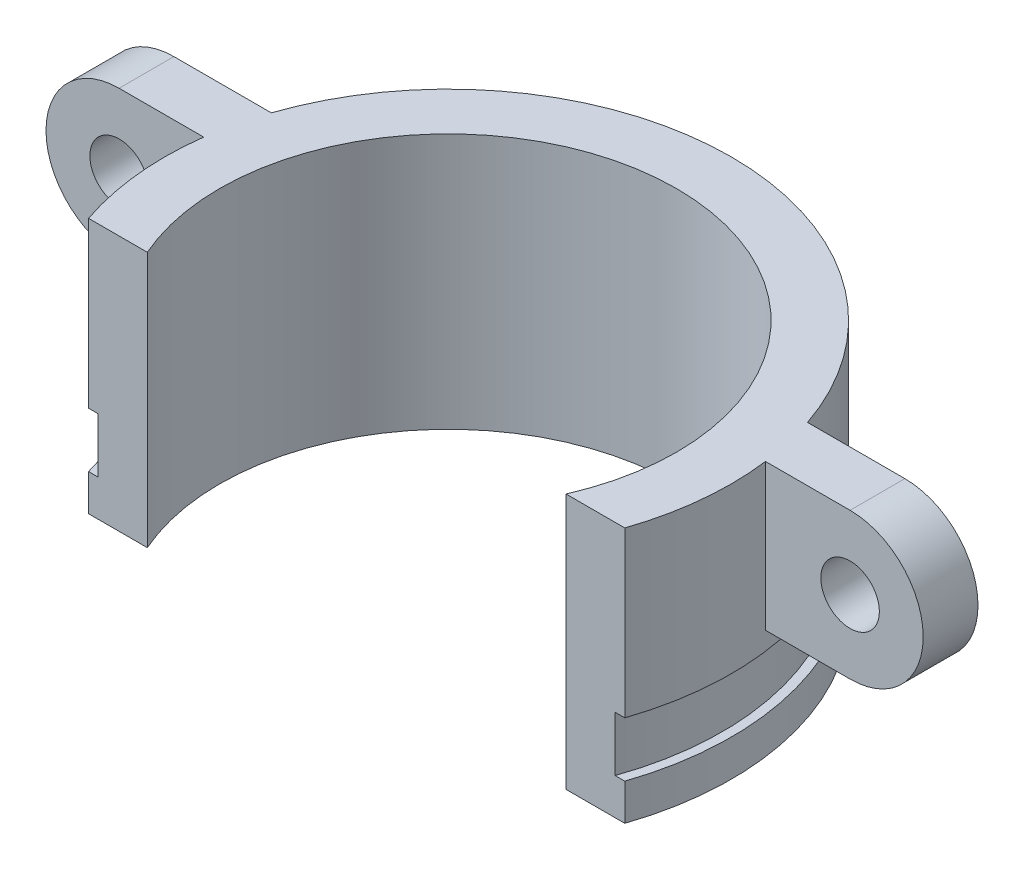
ISO-10303-21;
HEADER;
FILE_DESCRIPTION(('STEP AP214'),'2;1');
FILE_NAME('part.step','',(''),(''),'','','');
FILE_SCHEMA(('AUTOMOTIVE_DESIGN { 1 0 10303 214 1 1 1 1 }'));
ENDSEC;
DATA;
#1=APPLICATION_CONTEXT('core data for automotive mechanical design processes');
#2=APPLICATION_PROTOCOL_DEFINITION('international standard','automotive_design',2000,#1);
#3=PRODUCT_CONTEXT('',#1,'mechanical');
#4=PRODUCT('Part','Part','',(#3));
#5=PRODUCT_RELATED_PRODUCT_CATEGORY('part','',(#4));
#6=PRODUCT_DEFINITION_FORMATION('','',#4);
#7=PRODUCT_DEFINITION_CONTEXT('part definition',#1,'design');
#8=PRODUCT_DEFINITION('design','',#6,#7);
#9=PRODUCT_DEFINITION_SHAPE('','',#8);
#10=(LENGTH_UNIT() NAMED_UNIT(*) SI_UNIT(.MILLI.,.METRE.));
#11=(NAMED_UNIT(*) PLANE_ANGLE_UNIT() SI_UNIT($,.RADIAN.));
#12=(NAMED_UNIT(*) SI_UNIT($,.STERADIAN.) SOLID_ANGLE_UNIT());
#13=UNCERTAINTY_MEASURE_WITH_UNIT(LENGTH_MEASURE(1.E-05),#10,'distance_accuracy_value','');
#14=(GEOMETRIC_REPRESENTATION_CONTEXT(3) GLOBAL_UNCERTAINTY_ASSIGNED_CONTEXT((#13)) GLOBAL_UNIT_ASSIGNED_CONTEXT((#10,
#11,#12)) REPRESENTATION_CONTEXT('',''));
#15=CARTESIAN_POINT('',(0.,0.,0.));
#16=DIRECTION('',(0.,0.,1.));
#17=DIRECTION('',(1.,0.,0.));
#18=AXIS2_PLACEMENT_3D('',#15,#16,#17);
#19=CARTESIAN_POINT('',(0.,0.,0.));
#20=DIRECTION('',(0.,-1.,0.));
#21=DIRECTION('',(0.,0.,-1.));
#22=AXIS2_PLACEMENT_3D('',#19,#20,#21);
#23=CYLINDRICAL_SURFACE('',#22,15.5);
#24=CARTESIAN_POINT('',(0.,49.,0.));
#25=DIRECTION('',(0.,1.,0.));
#26=DIRECTION('',(-1.,0.,0.));
#27=AXIS2_PLACEMENT_3D('',#24,#25,#26);
#28=CIRCLE('',#27,15.5);
#29=CARTESIAN_POINT('',(-14.6714007511212,49.,-5.));
#30=VERTEX_POINT('',#29);
#31=CARTESIAN_POINT('',(14.6714007511212,49.,-5.));
#32=VERTEX_POINT('',#31);
#33=EDGE_CURVE('E166',#30,#32,#28,.F.);
#34=ORIENTED_EDGE('',*,*,#33,.T.);
#35=DIRECTION('',(0.,-1.,0.));
#36=VECTOR('',#35,1.);
#37=CARTESIAN_POINT('',(14.6714007511212,0.,-5.));
#38=LINE('',#37,#36);
#39=CARTESIAN_POINT('',(14.6714007511212,41.,-5.));
#40=VERTEX_POINT('',#39);
#41=EDGE_CURVE('E41',#40,#32,#38,.F.);
#42=ORIENTED_EDGE('',*,*,#41,.F.);
#43=CARTESIAN_POINT('',(0.,41.,0.));
#44=DIRECTION('',(0.,-1.,0.));
#45=DIRECTION('',(0.,0.,-1.));
#46=AXIS2_PLACEMENT_3D('',#43,#44,#45);
#47=CIRCLE('',#46,15.5);
#48=CARTESIAN_POINT('',(15.3704261489394,41.,-2.));
#49=VERTEX_POINT('',#48);
#50=EDGE_CURVE('E220',#49,#40,#47,.F.);
#51=ORIENTED_EDGE('',*,*,#50,.F.);
#52=DIRECTION('',(0.,-1.,0.));
#53=VECTOR('',#52,1.);
#54=CARTESIAN_POINT('',(15.3704261489394,0.,-2.));
#55=LINE('',#54,#53);
#56=CARTESIAN_POINT('',(15.3704261489394,49.,-2.));
#57=VERTEX_POINT('',#56);
#58=EDGE_CURVE('E163',#49,#57,#55,.F.);
#59=ORIENTED_EDGE('',*,*,#58,.T.);
#60=CARTESIAN_POINT('',(14.6714007511212,49.,5.));
#61=VERTEX_POINT('',#60);
#62=EDGE_CURVE('E147',#57,#61,#28,.F.);
#63=ORIENTED_EDGE('',*,*,#62,.T.);
#64=DIRECTION('',(0.,1.,0.));
#65=VECTOR('',#64,1.);
#66=CARTESIAN_POINT('',(14.6714007511212,0.,5.));
#67=LINE('',#66,#65);
#68=CARTESIAN_POINT('',(14.6714007511212,40.,5.));
#69=VERTEX_POINT('',#68);
#70=EDGE_CURVE('E160',#69,#61,#67,.T.);
#71=ORIENTED_EDGE('',*,*,#70,.F.);
#72=CARTESIAN_POINT('',(0.,40.,0.));
#73=DIRECTION('',(0.,-1.,0.));
#74=DIRECTION('',(0.,0.,-1.));
#75=AXIS2_PLACEMENT_3D('',#72,#73,#74);
#76=CIRCLE('',#75,15.5);
#77=CARTESIAN_POINT('',(-14.6714007511212,40.,5.));
#78=VERTEX_POINT('',#77);
#79=EDGE_CURVE('E203',#78,#69,#76,.T.);
#80=ORIENTED_EDGE('',*,*,#79,.F.);
#81=DIRECTION('',(0.,1.,0.));
#82=VECTOR('',#81,1.);
#83=CARTESIAN_POINT('',(-14.6714007511212,0.,5.));
#84=LINE('',#83,#82);
#85=CARTESIAN_POINT('',(-14.6714007511212,49.,5.));
#86=VERTEX_POINT('',#85);
#87=EDGE_CURVE('E174',#78,#86,#84,.T.);
#88=ORIENTED_EDGE('',*,*,#87,.T.);
#89=CARTESIAN_POINT('',(-15.3704261489394,49.,-2.));
#90=VERTEX_POINT('',#89);
#91=EDGE_CURVE('E164',#86,#90,#28,.F.);
#92=ORIENTED_EDGE('',*,*,#91,.T.);
#93=DIRECTION('',(0.,-1.,0.));
#94=VECTOR('',#93,1.);
#95=CARTESIAN_POINT('',(-15.3704261489394,0.,-2.));
#96=LINE('',#95,#94);
#97=CARTESIAN_POINT('',(-15.3704261489394,41.,-2.));
#98=VERTEX_POINT('',#97);
#99=EDGE_CURVE('E210',#98,#90,#96,.F.);
#100=ORIENTED_EDGE('',*,*,#99,.F.);
#101=CARTESIAN_POINT('',(0.,41.,0.));
#102=DIRECTION('',(0.,-1.,0.));
#103=DIRECTION('',(0.,0.,-1.));
#104=AXIS2_PLACEMENT_3D('',#101,#102,#103);
#105=CIRCLE('',#104,15.5);
#106=CARTESIAN_POINT('',(-14.6714007511212,41.,-5.));
#107=VERTEX_POINT('',#106);
#108=EDGE_CURVE('E213',#107,#98,#105,.F.);
#109=ORIENTED_EDGE('',*,*,#108,.F.);
#110=DIRECTION('',(0.,-1.,0.));
#111=VECTOR('',#110,1.);
#112=CARTESIAN_POINT('',(-14.6714007511212,0.,-5.));
#113=LINE('',#112,#111);
#114=EDGE_CURVE('E216',#107,#30,#113,.F.);
#115=ORIENTED_EDGE('',*,*,#114,.T.);
#116=EDGE_LOOP('',(#34,#42,#51,#59,#63,#71,#80,#88,#92,#100,#109,#115));
#117=FACE_BOUND('',#116,.T.);
#118=ADVANCED_FACE('F33',(#117),#23,.T.);
#119=CARTESIAN_POINT('',(0.,0.,0.));
#120=DIRECTION('',(0.,-1.,0.));
#121=DIRECTION('',(0.,0.,-1.));
#122=AXIS2_PLACEMENT_3D('',#119,#120,#121);
#123=CYLINDRICAL_SURFACE('',#122,15.5);
#124=CARTESIAN_POINT('',(0.,35.,0.));
#125=DIRECTION('',(0.,-1.,0.));
#126=DIRECTION('',(0.,0.,-1.));
#127=AXIS2_PLACEMENT_3D('',#124,#125,#126);
#128=CIRCLE('',#127,15.5);
#129=CARTESIAN_POINT('',(14.6714007511212,35.,5.));
#130=VERTEX_POINT('',#129);
#131=CARTESIAN_POINT('',(-14.6714007511212,35.,5.));
#132=VERTEX_POINT('',#131);
#133=EDGE_CURVE('E55',#130,#132,#128,.F.);
#134=ORIENTED_EDGE('',*,*,#133,.T.);
#135=CARTESIAN_POINT('',(-14.6714007511212,37.,5.));
#136=VERTEX_POINT('',#135);
#137=EDGE_CURVE('E171',#132,#136,#84,.T.);
#138=ORIENTED_EDGE('',*,*,#137,.T.);
#139=CARTESIAN_POINT('',(0.,37.,0.));
#140=DIRECTION('',(0.,-1.,0.));
#141=DIRECTION('',(0.,0.,-1.));
#142=AXIS2_PLACEMENT_3D('',#139,#140,#141);
#143=CIRCLE('',#142,15.5);
#144=CARTESIAN_POINT('',(14.6714007511212,37.,5.));
#145=VERTEX_POINT('',#144);
#146=EDGE_CURVE('E194',#136,#145,#143,.T.);
#147=ORIENTED_EDGE('',*,*,#146,.T.);
#148=EDGE_CURVE('E170',#130,#145,#67,.T.);
#149=ORIENTED_EDGE('',*,*,#148,.F.);
#150=EDGE_LOOP('',(#134,#138,#147,#149));
#151=FACE_BOUND('',#150,.T.);
#152=ADVANCED_FACE('F35',(#151),#123,.T.);
#153=CARTESIAN_POINT('',(0.,0.,0.));
#154=DIRECTION('',(0.,-1.,0.));
#155=DIRECTION('',(0.,0.,-1.));
#156=AXIS2_PLACEMENT_3D('',#153,#154,#155);
#157=CYLINDRICAL_SURFACE('',#156,12.5);
#158=DIRECTION('',(0.,1.,0.));
#159=VECTOR('',#158,1.);
#160=CARTESIAN_POINT('',(-11.4564392373896,0.,5.));
#161=LINE('',#160,#159);
#162=CARTESIAN_POINT('',(-11.4564392373896,35.,5.));
#163=VERTEX_POINT('',#162);
#164=CARTESIAN_POINT('',(-11.4564392373896,49.,5.));
#165=VERTEX_POINT('',#164);
#166=EDGE_CURVE('E182',#163,#165,#161,.T.);
#167=ORIENTED_EDGE('',*,*,#166,.F.);
#168=CARTESIAN_POINT('',(0.,35.,0.));
#169=DIRECTION('',(0.,-1.,0.));
#170=DIRECTION('',(0.,0.,-1.));
#171=AXIS2_PLACEMENT_3D('',#168,#169,#170);
#172=CIRCLE('',#171,12.5);
#173=CARTESIAN_POINT('',(11.4564392373896,35.,5.));
#174=VERTEX_POINT('',#173);
#175=EDGE_CURVE('E325',#163,#174,#172,.T.);
#176=ORIENTED_EDGE('',*,*,#175,.T.);
#177=DIRECTION('',(0.,1.,0.));
#178=VECTOR('',#177,1.);
#179=CARTESIAN_POINT('',(11.4564392373896,0.,5.));
#180=LINE('',#179,#178);
#181=CARTESIAN_POINT('',(11.4564392373896,49.,5.));
#182=VERTEX_POINT('',#181);
#183=EDGE_CURVE('E173',#174,#182,#180,.T.);
#184=ORIENTED_EDGE('',*,*,#183,.T.);
#185=CARTESIAN_POINT('',(0.,49.,0.));
#186=DIRECTION('',(0.,1.,0.));
#187=DIRECTION('',(-1.,0.,0.));
#188=AXIS2_PLACEMENT_3D('',#185,#186,#187);
#189=CIRCLE('',#188,12.5);
#190=EDGE_CURVE('E48',#182,#165,#189,.T.);
#191=ORIENTED_EDGE('',*,*,#190,.T.);
#192=EDGE_LOOP('',(#167,#176,#184,#191));
#193=FACE_BOUND('',#192,.T.);
#194=ADVANCED_FACE('F310',(#193),#157,.F.);
#195=CARTESIAN_POINT('',(0.,0.,5.));
#196=DIRECTION('',(0.,0.,1.));
#197=DIRECTION('',(1.,0.,0.));
#198=AXIS2_PLACEMENT_3D('',#195,#196,#197);
#199=PLANE('',#198);
#200=ORIENTED_EDGE('',*,*,#137,.F.);
#201=DIRECTION('',(1.,0.,0.));
#202=VECTOR('',#201,1.);
#203=CARTESIAN_POINT('',(25.7992620636876,35.,5.));
#204=LINE('',#203,#202);
#205=EDGE_CURVE('E153',#132,#163,#204,.T.);
#206=ORIENTED_EDGE('',*,*,#205,.T.);
#207=ORIENTED_EDGE('',*,*,#166,.T.);
#208=DIRECTION('',(-1.,0.,0.));
#209=VECTOR('',#208,1.);
#210=CARTESIAN_POINT('',(25.7992620636876,49.,5.));
#211=LINE('',#210,#209);
#212=EDGE_CURVE('E154',#165,#86,#211,.T.);
#213=ORIENTED_EDGE('',*,*,#212,.T.);
#214=ORIENTED_EDGE('',*,*,#87,.F.);
#215=DIRECTION('',(-1.,0.,0.));
#216=VECTOR('',#215,1.);
#217=CARTESIAN_POINT('',(15.5,40.,5.));
#218=LINE('',#217,#216);
#219=CARTESIAN_POINT('',(-14.1421356237309,40.,5.));
#220=VERTEX_POINT('',#219);
#221=EDGE_CURVE('E188',#220,#78,#218,.T.);
#222=ORIENTED_EDGE('',*,*,#221,.F.);
#223=DIRECTION('',(0.,-1.,0.));
#224=VECTOR('',#223,1.);
#225=CARTESIAN_POINT('',(-14.1421356237309,0.,5.));
#226=LINE('',#225,#224);
#227=CARTESIAN_POINT('',(-14.1421356237309,37.,5.));
#228=VERTEX_POINT('',#227);
#229=EDGE_CURVE('E181',#228,#220,#226,.F.);
#230=ORIENTED_EDGE('',*,*,#229,.F.);
#231=DIRECTION('',(1.,0.,0.));
#232=VECTOR('',#231,1.);
#233=CARTESIAN_POINT('',(15.,37.,5.));
#234=LINE('',#233,#232);
#235=EDGE_CURVE('E205',#136,#228,#234,.T.);
#236=ORIENTED_EDGE('',*,*,#235,.F.);
#237=EDGE_LOOP('',(#200,#206,#207,#213,#214,#222,#230,#236));
#238=FACE_BOUND('',#237,.T.);
#239=ADVANCED_FACE('F316',(#238),#199,.T.);
#240=CARTESIAN_POINT('',(0.,0.,5.));
#241=DIRECTION('',(0.,0.,-1.));
#242=DIRECTION('',(-1.,0.,0.));
#243=AXIS2_PLACEMENT_3D('',#240,#241,#242);
#244=PLANE('',#243);
#245=DIRECTION('',(-1.,0.,0.));
#246=VECTOR('',#245,1.);
#247=CARTESIAN_POINT('',(0.,35.,5.));
#248=LINE('',#247,#246);
#249=EDGE_CURVE('E11',#130,#174,#248,.T.);
#250=ORIENTED_EDGE('',*,*,#249,.F.);
#251=ORIENTED_EDGE('',*,*,#148,.T.);
#252=DIRECTION('',(-1.,0.,0.));
#253=VECTOR('',#252,1.);
#254=CARTESIAN_POINT('',(15.,37.,5.));
#255=LINE('',#254,#253);
#256=CARTESIAN_POINT('',(14.1421356237309,37.,5.));
#257=VERTEX_POINT('',#256);
#258=EDGE_CURVE('E208',#145,#257,#255,.T.);
#259=ORIENTED_EDGE('',*,*,#258,.T.);
#260=DIRECTION('',(0.,-1.,0.));
#261=VECTOR('',#260,1.);
#262=CARTESIAN_POINT('',(14.1421356237309,0.,5.));
#263=LINE('',#262,#261);
#264=CARTESIAN_POINT('',(14.1421356237309,40.,5.));
#265=VERTEX_POINT('',#264);
#266=EDGE_CURVE('E191',#257,#265,#263,.F.);
#267=ORIENTED_EDGE('',*,*,#266,.T.);
#268=DIRECTION('',(1.,0.,0.));
#269=VECTOR('',#268,1.);
#270=CARTESIAN_POINT('',(15.5,40.,5.));
#271=LINE('',#270,#269);
#272=EDGE_CURVE('E169',#265,#69,#271,.T.);
#273=ORIENTED_EDGE('',*,*,#272,.T.);
#274=ORIENTED_EDGE('',*,*,#70,.T.);
#275=EDGE_CURVE('E142',#61,#182,#211,.T.);
#276=ORIENTED_EDGE('',*,*,#275,.T.);
#277=ORIENTED_EDGE('',*,*,#183,.F.);
#278=EDGE_LOOP('',(#250,#251,#259,#267,#273,#274,#276,#277));
#279=FACE_BOUND('',#278,.T.);
#280=ADVANCED_FACE('F167',(#279),#244,.F.);
#281=CARTESIAN_POINT('',(15.5,40.,0.));
#282=DIRECTION('',(0.,-1.,0.));
#283=DIRECTION('',(0.,0.,-1.));
#284=AXIS2_PLACEMENT_3D('',#281,#282,#283);
#285=PLANE('',#284);
#286=ORIENTED_EDGE('',*,*,#272,.F.);
#287=CARTESIAN_POINT('',(0.,40.,0.));
#288=DIRECTION('',(0.,-1.,0.));
#289=DIRECTION('',(0.,0.,-1.));
#290=AXIS2_PLACEMENT_3D('',#287,#288,#289);
#291=CIRCLE('',#290,15.);
#292=EDGE_CURVE('E200',#220,#265,#291,.T.);
#293=ORIENTED_EDGE('',*,*,#292,.F.);
#294=ORIENTED_EDGE('',*,*,#221,.T.);
#295=ORIENTED_EDGE('',*,*,#79,.T.);
#296=EDGE_LOOP('',(#286,#293,#294,#295));
#297=FACE_BOUND('',#296,.T.);
#298=ADVANCED_FACE('F313',(#297),#285,.T.);
#299=CARTESIAN_POINT('',(0.,0.,0.));
#300=DIRECTION('',(0.,-1.,0.));
#301=DIRECTION('',(0.,0.,-1.));
#302=AXIS2_PLACEMENT_3D('',#299,#300,#301);
#303=CYLINDRICAL_SURFACE('',#302,15.);
#304=ORIENTED_EDGE('',*,*,#266,.F.);
#305=CARTESIAN_POINT('',(0.,37.,0.));
#306=DIRECTION('',(0.,-1.,0.));
#307=DIRECTION('',(0.,0.,-1.));
#308=AXIS2_PLACEMENT_3D('',#305,#306,#307);
#309=CIRCLE('',#308,15.);
#310=EDGE_CURVE('E197',#228,#257,#309,.T.);
#311=ORIENTED_EDGE('',*,*,#310,.F.);
#312=ORIENTED_EDGE('',*,*,#229,.T.);
#313=ORIENTED_EDGE('',*,*,#292,.T.);
#314=EDGE_LOOP('',(#304,#311,#312,#313));
#315=FACE_BOUND('',#314,.T.);
#316=ADVANCED_FACE('F480',(#315),#303,.T.);
#317=CARTESIAN_POINT('',(15.,37.,0.));
#318=DIRECTION('',(0.,1.,0.));
#319=DIRECTION('',(0.,0.,1.));
#320=AXIS2_PLACEMENT_3D('',#317,#318,#319);
#321=PLANE('',#320);
#322=ORIENTED_EDGE('',*,*,#258,.F.);
#323=ORIENTED_EDGE('',*,*,#146,.F.);
#324=ORIENTED_EDGE('',*,*,#235,.T.);
#325=ORIENTED_EDGE('',*,*,#310,.T.);
#326=EDGE_LOOP('',(#322,#323,#324,#325));
#327=FACE_BOUND('',#326,.T.);
#328=ADVANCED_FACE('F472',(#327),#321,.T.);
#329=CARTESIAN_POINT('',(-20.,41.,-5.));
#330=DIRECTION('',(0.,-1.,0.));
#331=DIRECTION('',(0.,0.,-1.));
#332=AXIS2_PLACEMENT_3D('',#329,#330,#331);
#333=PLANE('',#332);
#334=DIRECTION('',(1.,0.,0.));
#335=VECTOR('',#334,1.);
#336=CARTESIAN_POINT('',(-20.,41.,-5.));
#337=LINE('',#336,#335);
#338=CARTESIAN_POINT('',(-20.,41.,-5.));
#339=VERTEX_POINT('',#338);
#340=EDGE_CURVE('E264',#339,#107,#337,.T.);
#341=ORIENTED_EDGE('',*,*,#340,.T.);
#342=ORIENTED_EDGE('',*,*,#108,.T.);
#343=DIRECTION('',(1.,0.,0.));
#344=VECTOR('',#343,1.);
#345=CARTESIAN_POINT('',(-20.,41.,-2.));
#346=LINE('',#345,#344);
#347=CARTESIAN_POINT('',(-20.,41.,-2.));
#348=VERTEX_POINT('',#347);
#349=EDGE_CURVE('E261',#348,#98,#346,.T.);
#350=ORIENTED_EDGE('',*,*,#349,.F.);
#351=DIRECTION('',(0.,0.,1.));
#352=VECTOR('',#351,1.);
#353=CARTESIAN_POINT('',(-20.,41.,-5.));
#354=LINE('',#353,#352);
#355=EDGE_CURVE('E184',#339,#348,#354,.T.);
#356=ORIENTED_EDGE('',*,*,#355,.F.);
#357=EDGE_LOOP('',(#341,#342,#350,#356));
#358=FACE_BOUND('',#357,.T.);
#359=ADVANCED_FACE('F283',(#358),#333,.T.);
#360=CARTESIAN_POINT('',(-20.,45.,-5.));
#361=DIRECTION('',(0.,0.,1.));
#362=DIRECTION('',(1.,0.,0.));
#363=AXIS2_PLACEMENT_3D('',#360,#361,#362);
#364=CYLINDRICAL_SURFACE('',#363,4.00000000000001);
#365=CARTESIAN_POINT('',(-20.,45.,-2.));
#366=DIRECTION('',(0.,0.,1.));
#367=DIRECTION('',(1.,0.,0.));
#368=AXIS2_PLACEMENT_3D('',#365,#366,#367);
#369=CIRCLE('',#368,4.00000000000001);
#370=CARTESIAN_POINT('',(-20.,49.,-2.));
#371=VERTEX_POINT('',#370);
#372=EDGE_CURVE('E268',#371,#348,#369,.T.);
#373=ORIENTED_EDGE('',*,*,#372,.F.);
#374=DIRECTION('',(0.,0.,1.));
#375=VECTOR('',#374,1.);
#376=CARTESIAN_POINT('',(-20.,49.,-5.));
#377=LINE('',#376,#375);
#378=CARTESIAN_POINT('',(-20.,49.,-5.));
#379=VERTEX_POINT('',#378);
#380=EDGE_CURVE('E178',#379,#371,#377,.T.);
#381=ORIENTED_EDGE('',*,*,#380,.F.);
#382=CARTESIAN_POINT('',(-20.,45.,-5.));
#383=DIRECTION('',(0.,0.,1.));
#384=DIRECTION('',(1.,0.,0.));
#385=AXIS2_PLACEMENT_3D('',#382,#383,#384);
#386=CIRCLE('',#385,4.00000000000001);
#387=EDGE_CURVE('E260',#379,#339,#386,.T.);
#388=ORIENTED_EDGE('',*,*,#387,.T.);
#389=ORIENTED_EDGE('',*,*,#355,.T.);
#390=EDGE_LOOP('',(#373,#381,#388,#389));
#391=FACE_BOUND('',#390,.T.);
#392=ADVANCED_FACE('F278',(#391),#364,.T.);
#393=CARTESIAN_POINT('',(-13.5,49.,-5.));
#394=DIRECTION('',(0.,1.,0.));
#395=DIRECTION('',(-1.,0.,0.));
#396=AXIS2_PLACEMENT_3D('',#393,#394,#395);
#397=PLANE('',#396);
#398=DIRECTION('',(-1.,0.,0.));
#399=VECTOR('',#398,1.);
#400=CARTESIAN_POINT('',(-13.5,49.,-2.));
#401=LINE('',#400,#399);
#402=EDGE_CURVE('E255',#90,#371,#401,.T.);
#403=ORIENTED_EDGE('',*,*,#402,.F.);
#404=ORIENTED_EDGE('',*,*,#91,.F.);
#405=ORIENTED_EDGE('',*,*,#212,.F.);
#406=ORIENTED_EDGE('',*,*,#190,.F.);
#407=ORIENTED_EDGE('',*,*,#275,.F.);
#408=ORIENTED_EDGE('',*,*,#62,.F.);
#409=DIRECTION('',(-1.,0.,0.));
#410=VECTOR('',#409,1.);
#411=CARTESIAN_POINT('',(13.5,49.,-2.));
#412=LINE('',#411,#410);
#413=CARTESIAN_POINT('',(20.,49.,-2.));
#414=VERTEX_POINT('',#413);
#415=EDGE_CURVE('E243',#414,#57,#412,.T.);
#416=ORIENTED_EDGE('',*,*,#415,.F.);
#417=DIRECTION('',(0.,0.,1.));
#418=VECTOR('',#417,1.);
#419=CARTESIAN_POINT('',(20.,49.,-5.));
#420=LINE('',#419,#418);
#421=CARTESIAN_POINT('',(20.,49.,-5.));
#422=VERTEX_POINT('',#421);
#423=EDGE_CURVE('E232',#422,#414,#420,.T.);
#424=ORIENTED_EDGE('',*,*,#423,.F.);
#425=DIRECTION('',(-1.,0.,0.));
#426=VECTOR('',#425,1.);
#427=CARTESIAN_POINT('',(13.5,49.,-5.));
#428=LINE('',#427,#426);
#429=EDGE_CURVE('E229',#422,#32,#428,.T.);
#430=ORIENTED_EDGE('',*,*,#429,.T.);
#431=ORIENTED_EDGE('',*,*,#33,.F.);
#432=DIRECTION('',(-1.,0.,0.));
#433=VECTOR('',#432,1.);
#434=CARTESIAN_POINT('',(-13.5,49.,-5.));
#435=LINE('',#434,#433);
#436=EDGE_CURVE('E258',#30,#379,#435,.T.);
#437=ORIENTED_EDGE('',*,*,#436,.T.);
#438=ORIENTED_EDGE('',*,*,#380,.T.);
#439=EDGE_LOOP('',(#403,#404,#405,#406,#407,#408,#416,#424,#430,#431,#437,#438));
#440=FACE_BOUND('',#439,.T.);
#441=ADVANCED_FACE('F145',(#440),#397,.T.);
#442=CARTESIAN_POINT('',(-20.,45.,-5.));
#443=DIRECTION('',(0.,0.,1.));
#444=DIRECTION('',(1.,0.,0.));
#445=AXIS2_PLACEMENT_3D('',#442,#443,#444);
#446=PLANE('',#445);
#447=ORIENTED_EDGE('',*,*,#114,.F.);
#448=ORIENTED_EDGE('',*,*,#340,.F.);
#449=ORIENTED_EDGE('',*,*,#387,.F.);
#450=ORIENTED_EDGE('',*,*,#436,.F.);
#451=EDGE_LOOP('',(#447,#448,#449,#450));
#452=FACE_BOUND('',#451,.T.);
#453=CARTESIAN_POINT('',(-20.,45.,-5.));
#454=DIRECTION('',(0.,0.,1.));
#455=DIRECTION('',(1.,0.,0.));
#456=AXIS2_PLACEMENT_3D('',#453,#454,#455);
#457=CIRCLE('',#456,1.6);
#458=CARTESIAN_POINT('',(-18.4,45.,-5.));
#459=VERTEX_POINT('',#458);
#460=EDGE_CURVE('E252',#459,#459,#457,.T.);
#461=ORIENTED_EDGE('',*,*,#460,.T.);
#462=EDGE_LOOP('',(#461));
#463=FACE_BOUND('',#462,.T.);
#464=ADVANCED_FACE('F287',(#452,#463),#446,.F.);
#465=CARTESIAN_POINT('',(-20.,45.,-2.));
#466=DIRECTION('',(0.,0.,1.));
#467=DIRECTION('',(1.,0.,0.));
#468=AXIS2_PLACEMENT_3D('',#465,#466,#467);
#469=PLANE('',#468);
#470=CARTESIAN_POINT('',(-20.,45.,-2.));
#471=DIRECTION('',(0.,0.,1.));
#472=DIRECTION('',(1.,0.,0.));
#473=AXIS2_PLACEMENT_3D('',#470,#471,#472);
#474=CIRCLE('',#473,1.6);
#475=CARTESIAN_POINT('',(-18.4,45.,-2.));
#476=VERTEX_POINT('',#475);
#477=EDGE_CURVE('E250',#476,#476,#474,.T.);
#478=ORIENTED_EDGE('',*,*,#477,.F.);
#479=EDGE_LOOP('',(#478));
#480=FACE_BOUND('',#479,.T.);
#481=ORIENTED_EDGE('',*,*,#349,.T.);
#482=ORIENTED_EDGE('',*,*,#99,.T.);
#483=ORIENTED_EDGE('',*,*,#402,.T.);
#484=ORIENTED_EDGE('',*,*,#372,.T.);
#485=EDGE_LOOP('',(#481,#482,#483,#484));
#486=FACE_BOUND('',#485,.T.);
#487=ADVANCED_FACE('F281',(#480,#486),#469,.T.);
#488=CARTESIAN_POINT('',(-20.,45.,-5.));
#489=DIRECTION('',(0.,0.,1.));
#490=DIRECTION('',(1.,0.,0.));
#491=AXIS2_PLACEMENT_3D('',#488,#489,#490);
#492=CYLINDRICAL_SURFACE('',#491,1.6);
#493=ORIENTED_EDGE('',*,*,#460,.F.);
#494=EDGE_LOOP('',(#493));
#495=FACE_BOUND('',#494,.T.);
#496=ORIENTED_EDGE('',*,*,#477,.T.);
#497=EDGE_LOOP('',(#496));
#498=FACE_BOUND('',#497,.T.);
#499=ADVANCED_FACE('F293',(#495,#498),#492,.F.);
#500=CARTESIAN_POINT('',(20.,45.,-5.));
#501=DIRECTION('',(0.,0.,1.));
#502=DIRECTION('',(1.,0.,0.));
#503=AXIS2_PLACEMENT_3D('',#500,#501,#502);
#504=CYLINDRICAL_SURFACE('',#503,4.00000000000001);
#505=CARTESIAN_POINT('',(20.,45.,-2.));
#506=DIRECTION('',(0.,0.,1.));
#507=DIRECTION('',(-1.,0.,0.));
#508=AXIS2_PLACEMENT_3D('',#505,#506,#507);
#509=CIRCLE('',#508,4.00000000000001);
#510=CARTESIAN_POINT('',(20.,41.,-2.));
#511=VERTEX_POINT('',#510);
#512=EDGE_CURVE('E240',#511,#414,#509,.T.);
#513=ORIENTED_EDGE('',*,*,#512,.F.);
#514=DIRECTION('',(0.,0.,1.));
#515=VECTOR('',#514,1.);
#516=CARTESIAN_POINT('',(20.,41.,-5.));
#517=LINE('',#516,#515);
#518=CARTESIAN_POINT('',(20.,41.,-5.));
#519=VERTEX_POINT('',#518);
#520=EDGE_CURVE('E247',#519,#511,#517,.T.);
#521=ORIENTED_EDGE('',*,*,#520,.F.);
#522=CARTESIAN_POINT('',(20.,45.,-5.));
#523=DIRECTION('',(0.,0.,1.));
#524=DIRECTION('',(-1.,0.,0.));
#525=AXIS2_PLACEMENT_3D('',#522,#523,#524);
#526=CIRCLE('',#525,4.00000000000001);
#527=EDGE_CURVE('E233',#519,#422,#526,.T.);
#528=ORIENTED_EDGE('',*,*,#527,.T.);
#529=ORIENTED_EDGE('',*,*,#423,.T.);
#530=EDGE_LOOP('',(#513,#521,#528,#529));
#531=FACE_BOUND('',#530,.T.);
#532=ADVANCED_FACE('F296',(#531),#504,.T.);
#533=CARTESIAN_POINT('',(20.,41.,-5.));
#534=DIRECTION('',(0.,-1.,0.));
#535=DIRECTION('',(0.,0.,-1.));
#536=AXIS2_PLACEMENT_3D('',#533,#534,#535);
#537=PLANE('',#536);
#538=DIRECTION('',(1.,0.,0.));
#539=VECTOR('',#538,1.);
#540=CARTESIAN_POINT('',(20.,41.,-2.));
#541=LINE('',#540,#539);
#542=EDGE_CURVE('E236',#49,#511,#541,.T.);
#543=ORIENTED_EDGE('',*,*,#542,.F.);
#544=ORIENTED_EDGE('',*,*,#50,.T.);
#545=DIRECTION('',(1.,0.,0.));
#546=VECTOR('',#545,1.);
#547=CARTESIAN_POINT('',(20.,41.,-5.));
#548=LINE('',#547,#546);
#549=EDGE_CURVE('E231',#40,#519,#548,.T.);
#550=ORIENTED_EDGE('',*,*,#549,.T.);
#551=ORIENTED_EDGE('',*,*,#520,.T.);
#552=EDGE_LOOP('',(#543,#544,#550,#551));
#553=FACE_BOUND('',#552,.T.);
#554=ADVANCED_FACE('F354',(#553),#537,.T.);
#555=CARTESIAN_POINT('',(20.,45.,-5.));
#556=DIRECTION('',(0.,0.,-1.));
#557=DIRECTION('',(-1.,0.,0.));
#558=AXIS2_PLACEMENT_3D('',#555,#556,#557);
#559=PLANE('',#558);
#560=CARTESIAN_POINT('',(20.,45.,-5.));
#561=DIRECTION('',(0.,0.,1.));
#562=DIRECTION('',(-1.,0.,0.));
#563=AXIS2_PLACEMENT_3D('',#560,#561,#562);
#564=CIRCLE('',#563,1.6);
#565=CARTESIAN_POINT('',(18.4,45.,-5.));
#566=VERTEX_POINT('',#565);
#567=EDGE_CURVE('E244',#566,#566,#564,.T.);
#568=ORIENTED_EDGE('',*,*,#567,.T.);
#569=EDGE_LOOP('',(#568));
#570=FACE_BOUND('',#569,.T.);
#571=ORIENTED_EDGE('',*,*,#549,.F.);
#572=ORIENTED_EDGE('',*,*,#41,.T.);
#573=ORIENTED_EDGE('',*,*,#429,.F.);
#574=ORIENTED_EDGE('',*,*,#527,.F.);
#575=EDGE_LOOP('',(#571,#572,#573,#574));
#576=FACE_BOUND('',#575,.T.);
#577=ADVANCED_FACE('F227',(#570,#576),#559,.T.);
#578=CARTESIAN_POINT('',(20.,45.,-2.));
#579=DIRECTION('',(0.,0.,-1.));
#580=DIRECTION('',(-1.,0.,0.));
#581=AXIS2_PLACEMENT_3D('',#578,#579,#580);
#582=PLANE('',#581);
#583=ORIENTED_EDGE('',*,*,#58,.F.);
#584=ORIENTED_EDGE('',*,*,#542,.T.);
#585=ORIENTED_EDGE('',*,*,#512,.T.);
#586=ORIENTED_EDGE('',*,*,#415,.T.);
#587=EDGE_LOOP('',(#583,#584,#585,#586));
#588=FACE_BOUND('',#587,.T.);
#589=CARTESIAN_POINT('',(20.,45.,-2.));
#590=DIRECTION('',(0.,0.,1.));
#591=DIRECTION('',(-1.,0.,0.));
#592=AXIS2_PLACEMENT_3D('',#589,#590,#591);
#593=CIRCLE('',#592,1.6);
#594=CARTESIAN_POINT('',(18.4,45.,-2.));
#595=VERTEX_POINT('',#594);
#596=EDGE_CURVE('E336',#595,#595,#593,.T.);
#597=ORIENTED_EDGE('',*,*,#596,.F.);
#598=EDGE_LOOP('',(#597));
#599=FACE_BOUND('',#598,.T.);
#600=ADVANCED_FACE('F343',(#588,#599),#582,.F.);
#601=CARTESIAN_POINT('',(20.,45.,-5.));
#602=DIRECTION('',(0.,0.,1.));
#603=DIRECTION('',(1.,0.,0.));
#604=AXIS2_PLACEMENT_3D('',#601,#602,#603);
#605=CYLINDRICAL_SURFACE('',#604,1.6);
#606=ORIENTED_EDGE('',*,*,#567,.F.);
#607=EDGE_LOOP('',(#606));
#608=FACE_BOUND('',#607,.T.);
#609=ORIENTED_EDGE('',*,*,#596,.T.);
#610=EDGE_LOOP('',(#609));
#611=FACE_BOUND('',#610,.T.);
#612=ADVANCED_FACE('F341',(#608,#611),#605,.F.);
#613=CARTESIAN_POINT('',(25.7992620636876,35.,-15.5));
#614=DIRECTION('',(0.,-1.,0.));
#615=DIRECTION('',(0.,0.,-1.));
#616=AXIS2_PLACEMENT_3D('',#613,#614,#615);
#617=PLANE('',#616);
#618=ORIENTED_EDGE('',*,*,#133,.F.);
#619=ORIENTED_EDGE('',*,*,#249,.T.);
#620=ORIENTED_EDGE('',*,*,#175,.F.);
#621=ORIENTED_EDGE('',*,*,#205,.F.);
#622=EDGE_LOOP('',(#618,#619,#620,#621));
#623=FACE_BOUND('',#622,.T.);
#624=ADVANCED_FACE('F351',(#623),#617,.T.);
#625=CLOSED_SHELL('',(#118,#152,#194,#239,#280,#298,#316,#328,#359,#392,#441,#464,#487,#499,
#532,#554,#577,#600,#612,#624));
#626=MANIFOLD_SOLID_BREP('B2',#625);
#627=ADVANCED_BREP_SHAPE_REPRESENTATION('',(#18,#626),#14);
#628=SHAPE_DEFINITION_REPRESENTATION(#9,#627);
ENDSEC;
END-ISO-10303-21;
